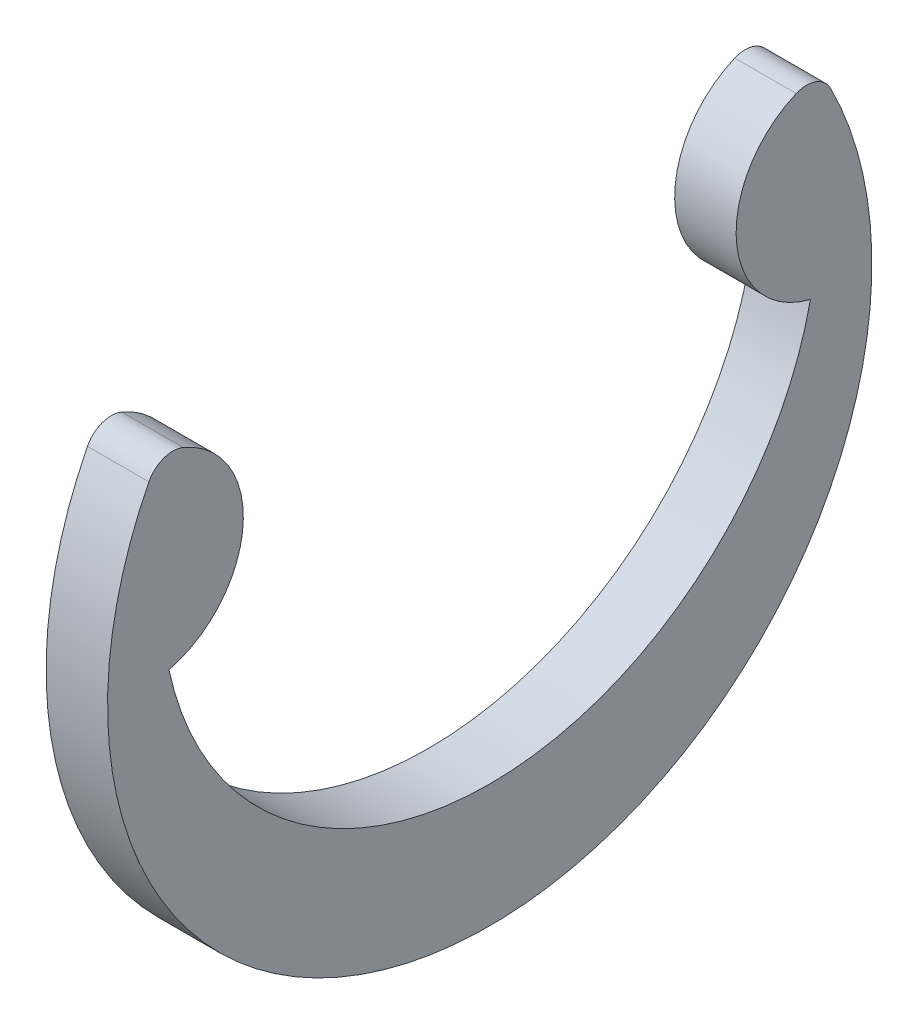
ISO-10303-21;
HEADER;
FILE_DESCRIPTION(('STEP AP214'),'2;1');
FILE_NAME('part.step','',(''),(''),'','','');
FILE_SCHEMA(('AUTOMOTIVE_DESIGN { 1 0 10303 214 1 1 1 1 }'));
ENDSEC;
DATA;
#1=APPLICATION_CONTEXT('core data for automotive mechanical design processes');
#2=APPLICATION_PROTOCOL_DEFINITION('international standard','automotive_design',2000,#1);
#3=PRODUCT_CONTEXT('',#1,'mechanical');
#4=PRODUCT('Part','Part','',(#3));
#5=PRODUCT_RELATED_PRODUCT_CATEGORY('part','',(#4));
#6=PRODUCT_DEFINITION_FORMATION('','',#4);
#7=PRODUCT_DEFINITION_CONTEXT('part definition',#1,'design');
#8=PRODUCT_DEFINITION('design','',#6,#7);
#9=PRODUCT_DEFINITION_SHAPE('','',#8);
#10=(LENGTH_UNIT() NAMED_UNIT(*) SI_UNIT(.MILLI.,.METRE.));
#11=(NAMED_UNIT(*) PLANE_ANGLE_UNIT() SI_UNIT($,.RADIAN.));
#12=(NAMED_UNIT(*) SI_UNIT($,.STERADIAN.) SOLID_ANGLE_UNIT());
#13=UNCERTAINTY_MEASURE_WITH_UNIT(LENGTH_MEASURE(1.E-05),#10,'distance_accuracy_value','');
#14=(GEOMETRIC_REPRESENTATION_CONTEXT(3) GLOBAL_UNCERTAINTY_ASSIGNED_CONTEXT((#13)) GLOBAL_UNIT_ASSIGNED_CONTEXT((#10,
#11,#12)) REPRESENTATION_CONTEXT('',''));
#15=CARTESIAN_POINT('',(0.,0.,0.));
#16=DIRECTION('',(0.,0.,1.));
#17=DIRECTION('',(1.,0.,0.));
#18=AXIS2_PLACEMENT_3D('',#15,#16,#17);
#19=CARTESIAN_POINT('',(-0.3175,0.846512328023186,1.77963484465552));
#20=DIRECTION('',(-1.,0.,0.));
#21=DIRECTION('',(0.,0.,1.));
#22=AXIS2_PLACEMENT_3D('',#19,#20,#21);
#23=PLANE('',#22);
#24=CARTESIAN_POINT('',(-0.3175,0.,0.));
#25=DIRECTION('',(-1.,0.,0.));
#26=DIRECTION('',(0.,0.,1.));
#27=AXIS2_PLACEMENT_3D('',#24,#25,#26);
#28=CIRCLE('',#27,3.9497);
#29=CARTESIAN_POINT('',(-0.3175,1.78646666666667,3.52259377999918));
#30=VERTEX_POINT('',#29);
#31=CARTESIAN_POINT('',(-0.3175,1.78646666666667,-3.52259377999918));
#32=VERTEX_POINT('',#31);
#33=EDGE_CURVE('E90',#30,#32,#28,.F.);
#34=ORIENTED_EDGE('',*,*,#33,.F.);
#35=CARTESIAN_POINT('',(-0.3175,1.66096845654136,3.27513368312914));
#36=DIRECTION('',(-1.,0.,0.));
#37=DIRECTION('',(0.,0.,1.));
#38=AXIS2_PLACEMENT_3D('',#35,#36,#37);
#39=CIRCLE('',#38,0.277464052243861);
#40=CARTESIAN_POINT('',(-0.3175,1.91687954310492,3.16791513967025));
#41=VERTEX_POINT('',#40);
#42=EDGE_CURVE('E80',#41,#30,#39,.F.);
#43=ORIENTED_EDGE('',*,*,#42,.F.);
#44=CARTESIAN_POINT('',(-0.3175,0.982787689221727,3.55926968931105));
#45=DIRECTION('',(-1.,0.,0.));
#46=DIRECTION('',(0.,0.,1.));
#47=AXIS2_PLACEMENT_3D('',#44,#45,#46);
#48=CIRCLE('',#47,1.01276155881603);
#49=CARTESIAN_POINT('',(-0.3175,0.,3.3147));
#50=VERTEX_POINT('',#49);
#51=EDGE_CURVE('E75',#50,#41,#48,.F.);
#52=ORIENTED_EDGE('',*,*,#51,.F.);
#53=CARTESIAN_POINT('',(-0.3175,0.710236966824645,0.));
#54=DIRECTION('',(-1.,0.,0.));
#55=DIRECTION('',(0.,0.,1.));
#56=AXIS2_PLACEMENT_3D('',#53,#54,#55);
#57=CIRCLE('',#56,3.38993696682464);
#58=CARTESIAN_POINT('',(-0.3175,0.,-3.3147));
#59=VERTEX_POINT('',#58);
#60=EDGE_CURVE('E19',#50,#59,#57,.F.);
#61=ORIENTED_EDGE('',*,*,#60,.T.);
#62=CARTESIAN_POINT('',(-0.3175,0.982787689221727,-3.55926968931105));
#63=DIRECTION('',(-1.,0.,0.));
#64=DIRECTION('',(0.,0.,1.));
#65=AXIS2_PLACEMENT_3D('',#62,#63,#64);
#66=CIRCLE('',#65,1.01276155881603);
#67=CARTESIAN_POINT('',(-0.3175,1.91687954310492,-3.16791513967025));
#68=VERTEX_POINT('',#67);
#69=EDGE_CURVE('E95',#68,#59,#66,.F.);
#70=ORIENTED_EDGE('',*,*,#69,.F.);
#71=CARTESIAN_POINT('',(-0.3175,1.66096845654136,-3.27513368312914));
#72=DIRECTION('',(-1.,0.,0.));
#73=DIRECTION('',(0.,0.,1.));
#74=AXIS2_PLACEMENT_3D('',#71,#72,#73);
#75=CIRCLE('',#74,0.277464052243861);
#76=EDGE_CURVE('E93',#32,#68,#75,.F.);
#77=ORIENTED_EDGE('',*,*,#76,.F.);
#78=EDGE_LOOP('',(#34,#43,#52,#61,#70,#77));
#79=FACE_BOUND('',#78,.T.);
#80=ADVANCED_FACE('F16',(#79),#23,.T.);
#81=CARTESIAN_POINT('',(0.3175,0.710236966824645,0.));
#82=DIRECTION('',(-1.,0.,0.));
#83=DIRECTION('',(0.,0.,1.));
#84=AXIS2_PLACEMENT_3D('',#81,#82,#83);
#85=CYLINDRICAL_SURFACE('',#84,3.38993696682464);
#86=DIRECTION('',(-1.,0.,0.));
#87=VECTOR('',#86,1.);
#88=CARTESIAN_POINT('',(0.3175,0.,3.3147));
#89=LINE('',#88,#87);
#90=CARTESIAN_POINT('',(0.3175,0.,3.3147));
#91=VERTEX_POINT('',#90);
#92=EDGE_CURVE('E69',#91,#50,#89,.T.);
#93=ORIENTED_EDGE('',*,*,#92,.F.);
#94=CARTESIAN_POINT('',(0.3175,0.710236966824645,0.));
#95=DIRECTION('',(-1.,0.,0.));
#96=DIRECTION('',(0.,0.,1.));
#97=AXIS2_PLACEMENT_3D('',#94,#95,#96);
#98=CIRCLE('',#97,3.38993696682464);
#99=CARTESIAN_POINT('',(0.3175,0.,-3.3147));
#100=VERTEX_POINT('',#99);
#101=EDGE_CURVE('E77',#91,#100,#98,.F.);
#102=ORIENTED_EDGE('',*,*,#101,.T.);
#103=DIRECTION('',(-1.,0.,0.));
#104=VECTOR('',#103,1.);
#105=CARTESIAN_POINT('',(0.3175,0.,-3.3147));
#106=LINE('',#105,#104);
#107=EDGE_CURVE('E70',#59,#100,#106,.F.);
#108=ORIENTED_EDGE('',*,*,#107,.F.);
#109=ORIENTED_EDGE('',*,*,#60,.F.);
#110=EDGE_LOOP('',(#93,#102,#108,#109));
#111=FACE_BOUND('',#110,.T.);
#112=ADVANCED_FACE('F67',(#111),#85,.F.);
#113=CARTESIAN_POINT('',(0.3175,0.982787689221727,-3.55926968931105));
#114=DIRECTION('',(-1.,0.,0.));
#115=DIRECTION('',(0.,0.,1.));
#116=AXIS2_PLACEMENT_3D('',#113,#114,#115);
#117=CYLINDRICAL_SURFACE('',#116,1.01276155881603);
#118=DIRECTION('',(-1.,0.,0.));
#119=VECTOR('',#118,1.);
#120=CARTESIAN_POINT('',(0.3175,1.91687954310492,-3.16791513967025));
#121=LINE('',#120,#119);
#122=CARTESIAN_POINT('',(0.3175,1.91687954310492,-3.16791513967025));
#123=VERTEX_POINT('',#122);
#124=EDGE_CURVE('E94',#68,#123,#121,.F.);
#125=ORIENTED_EDGE('',*,*,#124,.F.);
#126=ORIENTED_EDGE('',*,*,#69,.T.);
#127=ORIENTED_EDGE('',*,*,#107,.T.);
#128=CARTESIAN_POINT('',(0.3175,0.982787689221727,-3.55926968931105));
#129=DIRECTION('',(-1.,0.,0.));
#130=DIRECTION('',(0.,0.,1.));
#131=AXIS2_PLACEMENT_3D('',#128,#129,#130);
#132=CIRCLE('',#131,1.01276155881603);
#133=EDGE_CURVE('E110',#100,#123,#132,.T.);
#134=ORIENTED_EDGE('',*,*,#133,.T.);
#135=EDGE_LOOP('',(#125,#126,#127,#134));
#136=FACE_BOUND('',#135,.T.);
#137=ADVANCED_FACE('F167',(#136),#117,.T.);
#138=CARTESIAN_POINT('',(0.3175,1.66096845654136,-3.27513368312914));
#139=DIRECTION('',(-1.,0.,0.));
#140=DIRECTION('',(0.,0.,1.));
#141=AXIS2_PLACEMENT_3D('',#138,#139,#140);
#142=CYLINDRICAL_SURFACE('',#141,0.277464052243861);
#143=CARTESIAN_POINT('',(0.3175,1.66096845654136,-3.27513368312914));
#144=DIRECTION('',(-1.,0.,0.));
#145=DIRECTION('',(0.,0.,1.));
#146=AXIS2_PLACEMENT_3D('',#143,#144,#145);
#147=CIRCLE('',#146,0.277464052243861);
#148=CARTESIAN_POINT('',(0.3175,1.78646666666667,-3.52259377999918));
#149=VERTEX_POINT('',#148);
#150=EDGE_CURVE('E108',#123,#149,#147,.T.);
#151=ORIENTED_EDGE('',*,*,#150,.T.);
#152=DIRECTION('',(-1.,0.,0.));
#153=VECTOR('',#152,1.);
#154=CARTESIAN_POINT('',(0.3175,1.78646666666667,-3.52259377999918));
#155=LINE('',#154,#153);
#156=EDGE_CURVE('E92',#32,#149,#155,.F.);
#157=ORIENTED_EDGE('',*,*,#156,.F.);
#158=ORIENTED_EDGE('',*,*,#76,.T.);
#159=ORIENTED_EDGE('',*,*,#124,.T.);
#160=EDGE_LOOP('',(#151,#157,#158,#159));
#161=FACE_BOUND('',#160,.T.);
#162=ADVANCED_FACE('F119',(#161),#142,.T.);
#163=CARTESIAN_POINT('',(0.3175,0.,0.));
#164=DIRECTION('',(-1.,0.,0.));
#165=DIRECTION('',(0.,0.,1.));
#166=AXIS2_PLACEMENT_3D('',#163,#164,#165);
#167=CYLINDRICAL_SURFACE('',#166,3.9497);
#168=DIRECTION('',(-1.,0.,0.));
#169=VECTOR('',#168,1.);
#170=CARTESIAN_POINT('',(0.3175,1.78646666666667,3.52259377999918));
#171=LINE('',#170,#169);
#172=CARTESIAN_POINT('',(0.3175,1.78646666666667,3.52259377999918));
#173=VERTEX_POINT('',#172);
#174=EDGE_CURVE('E81',#30,#173,#171,.F.);
#175=ORIENTED_EDGE('',*,*,#174,.F.);
#176=ORIENTED_EDGE('',*,*,#33,.T.);
#177=ORIENTED_EDGE('',*,*,#156,.T.);
#178=CARTESIAN_POINT('',(0.3175,0.,0.));
#179=DIRECTION('',(-1.,0.,0.));
#180=DIRECTION('',(0.,0.,1.));
#181=AXIS2_PLACEMENT_3D('',#178,#179,#180);
#182=CIRCLE('',#181,3.9497);
#183=EDGE_CURVE('E106',#149,#173,#182,.T.);
#184=ORIENTED_EDGE('',*,*,#183,.T.);
#185=EDGE_LOOP('',(#175,#176,#177,#184));
#186=FACE_BOUND('',#185,.T.);
#187=ADVANCED_FACE('F123',(#186),#167,.T.);
#188=CARTESIAN_POINT('',(0.3175,1.66096845654136,3.27513368312914));
#189=DIRECTION('',(-1.,0.,0.));
#190=DIRECTION('',(0.,0.,1.));
#191=AXIS2_PLACEMENT_3D('',#188,#189,#190);
#192=CYLINDRICAL_SURFACE('',#191,0.277464052243861);
#193=CARTESIAN_POINT('',(0.3175,1.66096845654136,3.27513368312914));
#194=DIRECTION('',(-1.,0.,0.));
#195=DIRECTION('',(0.,0.,1.));
#196=AXIS2_PLACEMENT_3D('',#193,#194,#195);
#197=CIRCLE('',#196,0.277464052243861);
#198=CARTESIAN_POINT('',(0.3175,1.91687954310492,3.16791513967025));
#199=VERTEX_POINT('',#198);
#200=EDGE_CURVE('E25',#173,#199,#197,.T.);
#201=ORIENTED_EDGE('',*,*,#200,.T.);
#202=DIRECTION('',(-1.,0.,0.));
#203=VECTOR('',#202,1.);
#204=CARTESIAN_POINT('',(0.3175,1.91687954310492,3.16791513967025));
#205=LINE('',#204,#203);
#206=EDGE_CURVE('E33',#41,#199,#205,.F.);
#207=ORIENTED_EDGE('',*,*,#206,.F.);
#208=ORIENTED_EDGE('',*,*,#42,.T.);
#209=ORIENTED_EDGE('',*,*,#174,.T.);
#210=EDGE_LOOP('',(#201,#207,#208,#209));
#211=FACE_BOUND('',#210,.T.);
#212=ADVANCED_FACE('F125',(#211),#192,.T.);
#213=CARTESIAN_POINT('',(0.3175,0.982787689221727,3.55926968931105));
#214=DIRECTION('',(-1.,0.,0.));
#215=DIRECTION('',(0.,0.,1.));
#216=AXIS2_PLACEMENT_3D('',#213,#214,#215);
#217=CYLINDRICAL_SURFACE('',#216,1.01276155881603);
#218=CARTESIAN_POINT('',(0.3175,0.982787689221727,3.55926968931105));
#219=DIRECTION('',(-1.,0.,0.));
#220=DIRECTION('',(0.,0.,1.));
#221=AXIS2_PLACEMENT_3D('',#218,#219,#220);
#222=CIRCLE('',#221,1.01276155881603);
#223=EDGE_CURVE('E11',#199,#91,#222,.T.);
#224=ORIENTED_EDGE('',*,*,#223,.T.);
#225=ORIENTED_EDGE('',*,*,#92,.T.);
#226=ORIENTED_EDGE('',*,*,#51,.T.);
#227=ORIENTED_EDGE('',*,*,#206,.T.);
#228=EDGE_LOOP('',(#224,#225,#226,#227));
#229=FACE_BOUND('',#228,.T.);
#230=ADVANCED_FACE('F74',(#229),#217,.T.);
#231=CARTESIAN_POINT('',(0.3175,0.846512328023186,1.77963484465552));
#232=DIRECTION('',(-1.,0.,0.));
#233=DIRECTION('',(0.,0.,1.));
#234=AXIS2_PLACEMENT_3D('',#231,#232,#233);
#235=PLANE('',#234);
#236=ORIENTED_EDGE('',*,*,#200,.F.);
#237=ORIENTED_EDGE('',*,*,#183,.F.);
#238=ORIENTED_EDGE('',*,*,#150,.F.);
#239=ORIENTED_EDGE('',*,*,#133,.F.);
#240=ORIENTED_EDGE('',*,*,#101,.F.);
#241=ORIENTED_EDGE('',*,*,#223,.F.);
#242=EDGE_LOOP('',(#236,#237,#238,#239,#240,#241));
#243=FACE_BOUND('',#242,.T.);
#244=ADVANCED_FACE('F114',(#243),#235,.F.);
#245=CLOSED_SHELL('',(#80,#112,#137,#162,#187,#212,#230,#244));
#246=MANIFOLD_SOLID_BREP('B1',#245);
#247=ADVANCED_BREP_SHAPE_REPRESENTATION('',(#18,#246),#14);
#248=SHAPE_DEFINITION_REPRESENTATION(#9,#247);
ENDSEC;
END-ISO-10303-21;
